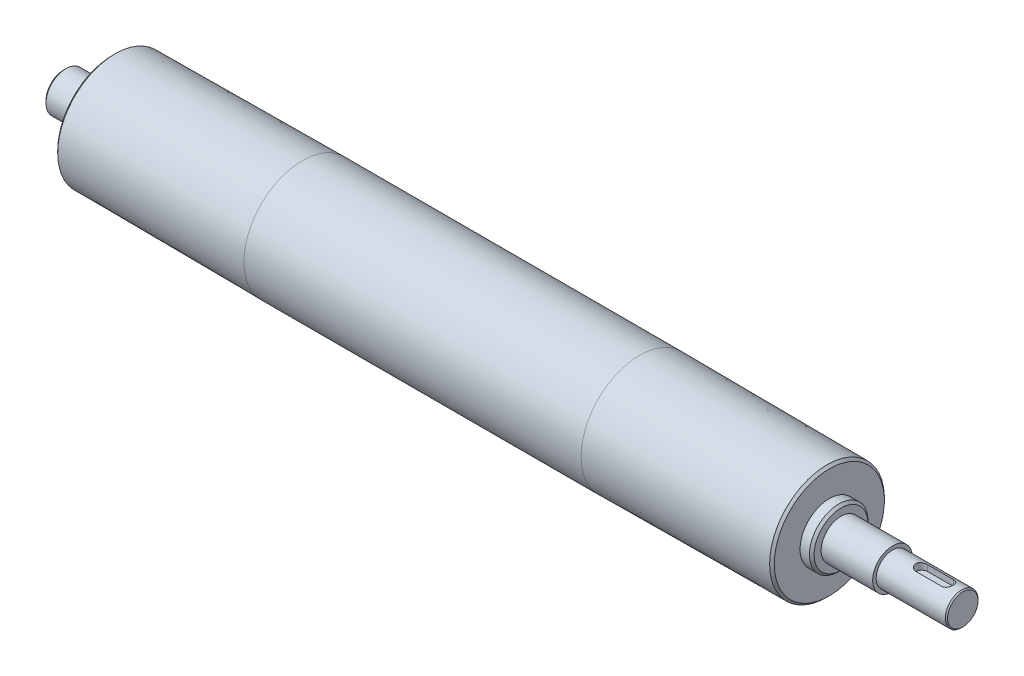
ISO-10303-21;
HEADER;
FILE_DESCRIPTION(('STEP AP214'),'2;1');
FILE_NAME('part.step','',(''),(''),'','','');
FILE_SCHEMA(('AUTOMOTIVE_DESIGN { 1 0 10303 214 1 1 1 1 }'));
ENDSEC;
DATA;
#1=APPLICATION_CONTEXT('core data for automotive mechanical design processes');
#2=APPLICATION_PROTOCOL_DEFINITION('international standard','automotive_design',2000,#1);
#3=PRODUCT_CONTEXT('',#1,'mechanical');
#4=PRODUCT('Part','Part','',(#3));
#5=PRODUCT_RELATED_PRODUCT_CATEGORY('part','',(#4));
#6=PRODUCT_DEFINITION_FORMATION('','',#4);
#7=PRODUCT_DEFINITION_CONTEXT('part definition',#1,'design');
#8=PRODUCT_DEFINITION('design','',#6,#7);
#9=PRODUCT_DEFINITION_SHAPE('','',#8);
#10=(LENGTH_UNIT() NAMED_UNIT(*) SI_UNIT(.MILLI.,.METRE.));
#11=(NAMED_UNIT(*) PLANE_ANGLE_UNIT() SI_UNIT($,.RADIAN.));
#12=(NAMED_UNIT(*) SI_UNIT($,.STERADIAN.) SOLID_ANGLE_UNIT());
#13=UNCERTAINTY_MEASURE_WITH_UNIT(LENGTH_MEASURE(1.E-05),#10,'distance_accuracy_value','');
#14=(GEOMETRIC_REPRESENTATION_CONTEXT(3) GLOBAL_UNCERTAINTY_ASSIGNED_CONTEXT((#13)) GLOBAL_UNIT_ASSIGNED_CONTEXT((#10,
#11,#12)) REPRESENTATION_CONTEXT('',''));
#15=CARTESIAN_POINT('',(0.,0.,0.));
#16=DIRECTION('',(0.,0.,1.));
#17=DIRECTION('',(1.,0.,0.));
#18=AXIS2_PLACEMENT_3D('',#15,#16,#17);
#19=CARTESIAN_POINT('',(-174.,0.,0.));
#20=DIRECTION('',(-1.,0.,0.));
#21=DIRECTION('',(0.,0.,1.));
#22=AXIS2_PLACEMENT_3D('',#19,#20,#21);
#23=CYLINDRICAL_SURFACE('',#22,7.);
#24=CARTESIAN_POINT('',(209.5,0.,0.));
#25=DIRECTION('',(-1.,0.,0.));
#26=DIRECTION('',(0.,0.,1.));
#27=AXIS2_PLACEMENT_3D('',#24,#25,#26);
#28=CIRCLE('',#27,7.);
#29=CARTESIAN_POINT('',(209.5,0.,7.));
#30=VERTEX_POINT('',#29);
#31=EDGE_CURVE('E133',#30,#30,#28,.T.);
#32=ORIENTED_EDGE('',*,*,#31,.T.);
#33=EDGE_LOOP('',(#32));
#34=FACE_BOUND('',#33,.T.);
#35=CARTESIAN_POINT('',(180.,0.,0.));
#36=DIRECTION('',(-1.,0.,0.));
#37=DIRECTION('',(0.,0.,1.));
#38=AXIS2_PLACEMENT_3D('',#35,#36,#37);
#39=CIRCLE('',#38,7.);
#40=CARTESIAN_POINT('',(180.,0.,7.));
#41=VERTEX_POINT('',#40);
#42=EDGE_CURVE('E130',#41,#41,#39,.T.);
#43=ORIENTED_EDGE('',*,*,#42,.F.);
#44=EDGE_LOOP('',(#43));
#45=FACE_BOUND('',#44,.T.);
#46=CARTESIAN_POINT('',(203.5,6.53834841531101,2.5));
#47=CARTESIAN_POINT('',(203.567889245729,6.53833653785133,2.50000932220903));
#48=CARTESIAN_POINT('',(203.635771932639,6.53940549922738,2.49723485076694));
#49=CARTESIAN_POINT('',(203.771003910611,6.54361657478134,2.4861910211816));
#50=CARTESIAN_POINT('',(203.838353358606,6.54675805418062,2.47792334551208));
#51=CARTESIAN_POINT('',(203.971821414603,6.55501217637942,2.456001752859));
#52=CARTESIAN_POINT('',(204.03794333634,6.56011831705676,2.44236559963956));
#53=CARTESIAN_POINT('',(204.168701835108,6.57213177854175,2.40985115466649));
#54=CARTESIAN_POINT('',(204.233338346312,6.57903917900746,2.39097263107436));
#55=CARTESIAN_POINT('',(204.424264366477,6.6021493436571,2.32673964179204));
#56=CARTESIAN_POINT('',(204.547790452136,6.62075475340845,2.27375112606985));
#57=CARTESIAN_POINT('',(204.784230333128,6.6622539736071,2.14910757865424));
#58=CARTESIAN_POINT('',(204.897136316735,6.68515090424876,2.07743895048847));
#59=CARTESIAN_POINT('',(205.114215213353,6.73379913792224,1.91402571101967));
#60=CARTESIAN_POINT('',(205.217846475196,6.75962864041372,1.82158337146742));
#61=CARTESIAN_POINT('',(205.408508704716,6.81057592323031,1.62073388776328));
#62=CARTESIAN_POINT('',(205.495536579243,6.83569357019868,1.51232377552671));
#63=CARTESIAN_POINT('',(205.653089855455,6.88331133279047,1.27853915335932));
#64=CARTESIAN_POINT('',(205.72303152186,6.90570835223797,1.15274833789182));
#65=CARTESIAN_POINT('',(205.840536646797,6.94442357672634,0.890250825476609));
#66=CARTESIAN_POINT('',(205.888107779046,6.96074386585466,0.753547890540304));
#67=CARTESIAN_POINT('',(205.957640602182,6.98491050510711,0.478829979256156));
#68=CARTESIAN_POINT('',(205.980539130471,6.99306594352515,0.341079835227449));
#69=CARTESIAN_POINT('',(206.003068402778,7.00108798053822,0.0634643052968886));
#70=CARTESIAN_POINT('',(206.002705586035,7.00095687302702,-0.0764004845074625));
#71=CARTESIAN_POINT('',(205.979288726239,6.99262258049077,-0.34759325848696));
#72=CARTESIAN_POINT('',(205.957255205801,6.98478243583516,-0.479022407078735));
#73=CARTESIAN_POINT('',(205.892826575841,6.96237832507347,-0.73617581214362));
#74=CARTESIAN_POINT('',(205.850430315637,6.94781397899037,-0.861899745780475));
#75=CARTESIAN_POINT('',(205.745953088435,6.91316506890368,-1.10616102429809));
#76=CARTESIAN_POINT('',(205.68360428504,6.89300592164314,-1.22457279066908));
#77=CARTESIAN_POINT('',(205.541220664777,6.8492335561632,-1.44953531305525));
#78=CARTESIAN_POINT('',(205.461180476216,6.82561928959263,-1.55608245176772));
#79=CARTESIAN_POINT('',(205.280676736343,6.77590547805489,-1.76032445256071));
#80=CARTESIAN_POINT('',(205.179350276855,6.74974055843875,-1.85724185700418));
#81=CARTESIAN_POINT('',(204.961672635834,6.69890342468975,-2.03299914621297));
#82=CARTESIAN_POINT('',(204.845316094832,6.67423174765257,-2.11183255456463));
#83=CARTESIAN_POINT('',(204.598057401478,6.62877803875405,-2.25049860898459));
#84=CARTESIAN_POINT('',(204.466921024495,6.60807875118994,-2.30994207989625));
#85=CARTESIAN_POINT('',(204.195635198418,6.57388213610267,-2.40555439725849));
#86=CARTESIAN_POINT('',(204.055500858831,6.56037307165054,-2.44176119399954));
#87=CARTESIAN_POINT('',(203.844969455736,6.54708542245562,-2.47705497148627));
#88=CARTESIAN_POINT('',(203.776263698228,6.54382010967907,-2.48565347586445));
#89=CARTESIAN_POINT('',(203.638384835808,6.53944910829676,-2.49712352174882));
#90=CARTESIAN_POINT('',(203.569212332899,6.53834103140935,-2.50000139665368));
#91=CARTESIAN_POINT('',(203.5,6.53834841531101,-2.5));
#92=B_SPLINE_CURVE_WITH_KNOTS('',3,(#46,#47,#48,#49,#50,#51,#52,#53,#54,#55,#56,#57,#58,#59,#60,
#61,#62,#63,#64,#65,#66,#67,#68,#69,#70,#71,#72,#73,#74,#75,#76,#77,#78,#79,#80,#81,#82,#83,#84,
#85,#86,#87,#88,#89,#90,#91),.UNSPECIFIED.,.F.,.F.,(4,2,2,2,2,2,2,2,2,2,2,2,2,2,2,2,2,2,2,2,2,2,
4),(0.,0.203591628551585,0.407120929225507,0.609982356545697,0.812852756636004,1.21793118555515,
1.62330528148473,2.04515972311932,2.46709267811843,2.90188398965563,3.33652604665239,
3.75400993940863,4.17137826416923,4.56998920861348,4.96862268086889,5.37284909448641,
5.77719841367923,6.20315837945089,6.62927065674719,7.06347329058504,7.49696496492445,
7.70468580162772,7.91217653896406),.UNSPECIFIED.);
#93=CARTESIAN_POINT('',(203.5,6.53834841531102,2.5));
#94=VERTEX_POINT('',#93);
#95=CARTESIAN_POINT('',(203.5,6.53834841531102,-2.5));
#96=VERTEX_POINT('',#95);
#97=EDGE_CURVE('E11',#94,#96,#92,.T.);
#98=ORIENTED_EDGE('',*,*,#97,.F.);
#99=DIRECTION('',(-1.,0.,0.));
#100=VECTOR('',#99,1.);
#101=CARTESIAN_POINT('',(-174.,6.53834841531101,2.5));
#102=LINE('',#101,#100);
#103=CARTESIAN_POINT('',(192.5,6.53834841531101,2.5));
#104=VERTEX_POINT('',#103);
#105=EDGE_CURVE('E163',#94,#104,#102,.T.);
#106=ORIENTED_EDGE('',*,*,#105,.T.);
#107=CARTESIAN_POINT('',(192.5,6.53834841531101,-2.5));
#108=CARTESIAN_POINT('',(192.432110754271,6.53833653785133,-2.50000932220903));
#109=CARTESIAN_POINT('',(192.364228067361,6.53940549922738,-2.49723485076694));
#110=CARTESIAN_POINT('',(192.228996089389,6.54361657478134,-2.4861910211816));
#111=CARTESIAN_POINT('',(192.161646641394,6.54675805418062,-2.47792334551208));
#112=CARTESIAN_POINT('',(192.028178585397,6.55501217637942,-2.456001752859));
#113=CARTESIAN_POINT('',(191.96205666366,6.56011831705676,-2.44236559963955));
#114=CARTESIAN_POINT('',(191.831298164892,6.57213177854175,-2.40985115466648));
#115=CARTESIAN_POINT('',(191.766661653688,6.57903917900746,-2.39097263107435));
#116=CARTESIAN_POINT('',(191.575735633522,6.6021493436571,-2.32673964179204));
#117=CARTESIAN_POINT('',(191.452209547864,6.62075475340845,-2.27375112606985));
#118=CARTESIAN_POINT('',(191.215769666872,6.6622539736071,-2.14910757865424));
#119=CARTESIAN_POINT('',(191.102863683264,6.68515090424876,-2.07743895048847));
#120=CARTESIAN_POINT('',(190.885784786647,6.73379913792224,-1.91402571101968));
#121=CARTESIAN_POINT('',(190.782153524804,6.75962864041372,-1.82158337146742));
#122=CARTESIAN_POINT('',(190.591491295284,6.81057592323031,-1.62073388776328));
#123=CARTESIAN_POINT('',(190.504463420757,6.83569357019868,-1.51232377552671));
#124=CARTESIAN_POINT('',(190.346910144545,6.88331133279047,-1.27853915335932));
#125=CARTESIAN_POINT('',(190.276968478139,6.90570835223797,-1.15274833789182));
#126=CARTESIAN_POINT('',(190.159463353203,6.94442357672634,-0.890250825476609));
#127=CARTESIAN_POINT('',(190.111892220954,6.96074386585466,-0.753547890540304));
#128=CARTESIAN_POINT('',(190.042359397818,6.98491050510711,-0.478829979256155));
#129=CARTESIAN_POINT('',(190.019460869529,6.99306594352515,-0.341079835227448));
#130=CARTESIAN_POINT('',(189.996931597222,7.00108798053822,-0.0634643052968871));
#131=CARTESIAN_POINT('',(189.997294413965,7.00095687302702,0.0764004845074633));
#132=CARTESIAN_POINT('',(190.020711273761,6.99262258049077,0.347593258486962));
#133=CARTESIAN_POINT('',(190.042744794199,6.98478243583516,0.479022407078739));
#134=CARTESIAN_POINT('',(190.107173424159,6.96237832507347,0.736175812143625));
#135=CARTESIAN_POINT('',(190.149569684362,6.94781397899037,0.861899745780477));
#136=CARTESIAN_POINT('',(190.254046911565,6.91316506890368,1.10616102429809));
#137=CARTESIAN_POINT('',(190.31639571496,6.89300592164314,1.22457279066908));
#138=CARTESIAN_POINT('',(190.458779335223,6.8492335561632,1.44953531305525));
#139=CARTESIAN_POINT('',(190.538819523784,6.82561928959263,1.55608245176772));
#140=CARTESIAN_POINT('',(190.719323263657,6.7759054780549,1.7603244525607));
#141=CARTESIAN_POINT('',(190.820649723145,6.74974055843875,1.85724185700416));
#142=CARTESIAN_POINT('',(191.038327364166,6.69890342468976,2.03299914621295));
#143=CARTESIAN_POINT('',(191.154683905168,6.67423174765257,2.11183255456462));
#144=CARTESIAN_POINT('',(191.401942598522,6.62877803875405,2.25049860898459));
#145=CARTESIAN_POINT('',(191.533078975505,6.60807875118994,2.30994207989625));
#146=CARTESIAN_POINT('',(191.804364801582,6.57388213610267,2.40555439725849));
#147=CARTESIAN_POINT('',(191.944499141169,6.56037307165054,2.44176119399954));
#148=CARTESIAN_POINT('',(192.155030544264,6.54708542245562,2.47705497148627));
#149=CARTESIAN_POINT('',(192.223736301772,6.54382010967907,2.48565347586445));
#150=CARTESIAN_POINT('',(192.361615164192,6.53944910829676,2.49712352174882));
#151=CARTESIAN_POINT('',(192.430787667101,6.53834103140935,2.50000139665368));
#152=CARTESIAN_POINT('',(192.5,6.53834841531101,2.5));
#153=B_SPLINE_CURVE_WITH_KNOTS('',3,(#107,#108,#109,#110,#111,#112,#113,#114,#115,#116,#117,
#118,#119,#120,#121,#122,#123,#124,#125,#126,#127,#128,#129,#130,#131,#132,#133,#134,#135,#136,
#137,#138,#139,#140,#141,#142,#143,#144,#145,#146,#147,#148,#149,#150,#151,#152),.UNSPECIFIED.,
.F.,.F.,(4,2,2,2,2,2,2,2,2,2,2,2,2,2,2,2,2,2,2,2,2,2,4),(0.,0.203591628551613,0.407120929225535,
0.609982356545727,0.812852756636003,1.21793118555515,1.62330528148473,2.04515972311932,
2.46709267811843,2.90188398965563,3.33652604665239,3.75400993940863,4.17137826416923,
4.56998920861349,4.96862268086889,5.37284909448641,5.77719841367923,6.20315837945085,
6.62927065674719,7.06347329058504,7.49696496492445,7.70468580162772,7.91217653896406),.UNSPECIFIED.);
#154=CARTESIAN_POINT('',(192.5,6.53834841531101,-2.5));
#155=VERTEX_POINT('',#154);
#156=EDGE_CURVE('E166',#155,#104,#153,.T.);
#157=ORIENTED_EDGE('',*,*,#156,.F.);
#158=DIRECTION('',(-1.,0.,0.));
#159=VECTOR('',#158,1.);
#160=CARTESIAN_POINT('',(-174.,6.53834841531101,-2.5));
#161=LINE('',#160,#159);
#162=EDGE_CURVE('E44',#96,#155,#161,.T.);
#163=ORIENTED_EDGE('',*,*,#162,.F.);
#164=EDGE_LOOP('',(#98,#106,#157,#163));
#165=FACE_BOUND('',#164,.T.);
#166=ADVANCED_FACE('F31',(#34,#45,#165),#23,.T.);
#167=CARTESIAN_POINT('',(-72.,0.,0.));
#168=DIRECTION('',(1.,0.,0.));
#169=DIRECTION('',(0.,0.,-1.));
#170=AXIS2_PLACEMENT_3D('',#167,#168,#169);
#171=CONICAL_SURFACE('',#170,25.,0.00624991862169927);
#172=CARTESIAN_POINT('',(-152.,0.,0.));
#173=DIRECTION('',(-1.,0.,0.));
#174=DIRECTION('',(0.,0.,1.));
#175=AXIS2_PLACEMENT_3D('',#172,#173,#174);
#176=CIRCLE('',#175,24.5);
#177=CARTESIAN_POINT('',(-152.,0.,24.5));
#178=VERTEX_POINT('',#177);
#179=EDGE_CURVE('E160',#178,#178,#176,.T.);
#180=ORIENTED_EDGE('',*,*,#179,.F.);
#181=EDGE_LOOP('',(#180));
#182=FACE_BOUND('',#181,.T.);
#183=CARTESIAN_POINT('',(-72.,0.,0.));
#184=DIRECTION('',(-1.,0.,0.));
#185=DIRECTION('',(0.,0.,1.));
#186=AXIS2_PLACEMENT_3D('',#183,#184,#185);
#187=CIRCLE('',#186,25.);
#188=CARTESIAN_POINT('',(-72.,0.,25.));
#189=VERTEX_POINT('',#188);
#190=EDGE_CURVE('E82',#189,#189,#187,.T.);
#191=ORIENTED_EDGE('',*,*,#190,.T.);
#192=EDGE_LOOP('',(#191));
#193=FACE_BOUND('',#192,.T.);
#194=ADVANCED_FACE('F33',(#182,#193),#171,.T.);
#195=CARTESIAN_POINT('',(-152.,0.,0.));
#196=DIRECTION('',(1.,0.,0.));
#197=DIRECTION('',(0.,0.,-1.));
#198=AXIS2_PLACEMENT_3D('',#195,#196,#197);
#199=CONICAL_SURFACE('',#198,24.5,0.785398163397459);
#200=CARTESIAN_POINT('',(-153.,0.,0.));
#201=DIRECTION('',(-1.,0.,0.));
#202=DIRECTION('',(0.,0.,1.));
#203=AXIS2_PLACEMENT_3D('',#200,#201,#202);
#204=CIRCLE('',#203,23.5);
#205=CARTESIAN_POINT('',(-153.,0.,23.5));
#206=VERTEX_POINT('',#205);
#207=EDGE_CURVE('E157',#206,#206,#204,.T.);
#208=ORIENTED_EDGE('',*,*,#207,.F.);
#209=EDGE_LOOP('',(#208));
#210=FACE_BOUND('',#209,.T.);
#211=ORIENTED_EDGE('',*,*,#179,.T.);
#212=EDGE_LOOP('',(#211));
#213=FACE_BOUND('',#212,.T.);
#214=ADVANCED_FACE('F233',(#210,#213),#199,.T.);
#215=CARTESIAN_POINT('',(-153.,0.,-23.5));
#216=DIRECTION('',(1.,0.,0.));
#217=DIRECTION('',(0.,0.,-1.));
#218=AXIS2_PLACEMENT_3D('',#215,#216,#217);
#219=PLANE('',#218);
#220=CARTESIAN_POINT('',(-153.,0.,0.));
#221=DIRECTION('',(-1.,0.,0.));
#222=DIRECTION('',(0.,0.,1.));
#223=AXIS2_PLACEMENT_3D('',#220,#221,#222);
#224=CIRCLE('',#223,12.5);
#225=CARTESIAN_POINT('',(-153.,0.,12.5));
#226=VERTEX_POINT('',#225);
#227=EDGE_CURVE('E154',#226,#226,#224,.T.);
#228=ORIENTED_EDGE('',*,*,#227,.F.);
#229=EDGE_LOOP('',(#228));
#230=FACE_BOUND('',#229,.T.);
#231=ORIENTED_EDGE('',*,*,#207,.T.);
#232=EDGE_LOOP('',(#231));
#233=FACE_BOUND('',#232,.T.);
#234=ADVANCED_FACE('F399',(#230,#233),#219,.F.);
#235=CARTESIAN_POINT('',(-174.,0.,0.));
#236=DIRECTION('',(-1.,0.,0.));
#237=DIRECTION('',(0.,0.,1.));
#238=AXIS2_PLACEMENT_3D('',#235,#236,#237);
#239=CYLINDRICAL_SURFACE('',#238,12.5);
#240=CARTESIAN_POINT('',(-157.,0.,0.));
#241=DIRECTION('',(-1.,0.,0.));
#242=DIRECTION('',(0.,0.,1.));
#243=AXIS2_PLACEMENT_3D('',#240,#241,#242);
#244=CIRCLE('',#243,12.5);
#245=CARTESIAN_POINT('',(-157.,0.,12.5));
#246=VERTEX_POINT('',#245);
#247=EDGE_CURVE('E151',#246,#246,#244,.T.);
#248=ORIENTED_EDGE('',*,*,#247,.F.);
#249=EDGE_LOOP('',(#248));
#250=FACE_BOUND('',#249,.T.);
#251=ORIENTED_EDGE('',*,*,#227,.T.);
#252=EDGE_LOOP('',(#251));
#253=FACE_BOUND('',#252,.T.);
#254=ADVANCED_FACE('F389',(#250,#253),#239,.T.);
#255=CARTESIAN_POINT('',(-157.,0.,0.));
#256=DIRECTION('',(1.,0.,0.));
#257=DIRECTION('',(0.,0.,-1.));
#258=AXIS2_PLACEMENT_3D('',#255,#256,#257);
#259=CONICAL_SURFACE('',#258,12.5,0.78539816339745);
#260=CARTESIAN_POINT('',(-158.,0.,0.));
#261=DIRECTION('',(-1.,0.,0.));
#262=DIRECTION('',(0.,0.,1.));
#263=AXIS2_PLACEMENT_3D('',#260,#261,#262);
#264=CIRCLE('',#263,11.5);
#265=CARTESIAN_POINT('',(-158.,0.,11.5));
#266=VERTEX_POINT('',#265);
#267=EDGE_CURVE('E148',#266,#266,#264,.T.);
#268=ORIENTED_EDGE('',*,*,#267,.F.);
#269=EDGE_LOOP('',(#268));
#270=FACE_BOUND('',#269,.T.);
#271=ORIENTED_EDGE('',*,*,#247,.T.);
#272=EDGE_LOOP('',(#271));
#273=FACE_BOUND('',#272,.T.);
#274=ADVANCED_FACE('F379',(#270,#273),#259,.T.);
#275=CARTESIAN_POINT('',(-158.,0.,-11.5));
#276=DIRECTION('',(1.,0.,0.));
#277=DIRECTION('',(0.,0.,-1.));
#278=AXIS2_PLACEMENT_3D('',#275,#276,#277);
#279=PLANE('',#278);
#280=CARTESIAN_POINT('',(-158.,0.,0.));
#281=DIRECTION('',(-1.,0.,0.));
#282=DIRECTION('',(0.,0.,1.));
#283=AXIS2_PLACEMENT_3D('',#280,#281,#282);
#284=CIRCLE('',#283,8.5);
#285=CARTESIAN_POINT('',(-158.,0.,8.5));
#286=VERTEX_POINT('',#285);
#287=EDGE_CURVE('E145',#286,#286,#284,.T.);
#288=ORIENTED_EDGE('',*,*,#287,.F.);
#289=EDGE_LOOP('',(#288));
#290=FACE_BOUND('',#289,.T.);
#291=ORIENTED_EDGE('',*,*,#267,.T.);
#292=EDGE_LOOP('',(#291));
#293=FACE_BOUND('',#292,.T.);
#294=ADVANCED_FACE('F369',(#290,#293),#279,.F.);
#295=CARTESIAN_POINT('',(-174.,0.,0.));
#296=DIRECTION('',(-1.,0.,0.));
#297=DIRECTION('',(0.,0.,1.));
#298=AXIS2_PLACEMENT_3D('',#295,#296,#297);
#299=CYLINDRICAL_SURFACE('',#298,8.5);
#300=CARTESIAN_POINT('',(-173.,0.,0.));
#301=DIRECTION('',(-1.,0.,0.));
#302=DIRECTION('',(0.,0.,1.));
#303=AXIS2_PLACEMENT_3D('',#300,#301,#302);
#304=CIRCLE('',#303,8.49999999999999);
#305=CARTESIAN_POINT('',(-173.,0.,8.49999999999999));
#306=VERTEX_POINT('',#305);
#307=EDGE_CURVE('E142',#306,#306,#304,.T.);
#308=ORIENTED_EDGE('',*,*,#307,.F.);
#309=EDGE_LOOP('',(#308));
#310=FACE_BOUND('',#309,.T.);
#311=ORIENTED_EDGE('',*,*,#287,.T.);
#312=EDGE_LOOP('',(#311));
#313=FACE_BOUND('',#312,.T.);
#314=ADVANCED_FACE('F359',(#310,#313),#299,.T.);
#315=CARTESIAN_POINT('',(-173.,0.,0.));
#316=DIRECTION('',(1.,0.,0.));
#317=DIRECTION('',(0.,0.,-1.));
#318=AXIS2_PLACEMENT_3D('',#315,#316,#317);
#319=CONICAL_SURFACE('',#318,8.49999999999999,0.785398163397458);
#320=CARTESIAN_POINT('',(-174.,0.,0.));
#321=DIRECTION('',(-1.,0.,0.));
#322=DIRECTION('',(0.,0.,1.));
#323=AXIS2_PLACEMENT_3D('',#320,#321,#322);
#324=CIRCLE('',#323,7.49999999999998);
#325=CARTESIAN_POINT('',(-174.,0.,7.49999999999998));
#326=VERTEX_POINT('',#325);
#327=EDGE_CURVE('E139',#326,#326,#324,.T.);
#328=ORIENTED_EDGE('',*,*,#327,.F.);
#329=EDGE_LOOP('',(#328));
#330=FACE_BOUND('',#329,.T.);
#331=ORIENTED_EDGE('',*,*,#307,.T.);
#332=EDGE_LOOP('',(#331));
#333=FACE_BOUND('',#332,.T.);
#334=ADVANCED_FACE('F349',(#330,#333),#319,.T.);
#335=CARTESIAN_POINT('',(-174.,0.,-7.49999999999998));
#336=DIRECTION('',(1.,0.,0.));
#337=DIRECTION('',(0.,0.,-1.));
#338=AXIS2_PLACEMENT_3D('',#335,#336,#337);
#339=PLANE('',#338);
#340=ORIENTED_EDGE('',*,*,#327,.T.);
#341=EDGE_LOOP('',(#340));
#342=FACE_BOUND('',#341,.T.);
#343=ADVANCED_FACE('F339',(#342),#339,.F.);
#344=CARTESIAN_POINT('',(210.,0.,-6.50000000000001));
#345=DIRECTION('',(-1.,0.,0.));
#346=DIRECTION('',(0.,0.,1.));
#347=AXIS2_PLACEMENT_3D('',#344,#345,#346);
#348=PLANE('',#347);
#349=CARTESIAN_POINT('',(210.,0.,0.));
#350=DIRECTION('',(-1.,0.,0.));
#351=DIRECTION('',(0.,0.,1.));
#352=AXIS2_PLACEMENT_3D('',#349,#350,#351);
#353=CIRCLE('',#352,6.50000000000001);
#354=CARTESIAN_POINT('',(210.,0.,6.50000000000001));
#355=VERTEX_POINT('',#354);
#356=EDGE_CURVE('E136',#355,#355,#353,.T.);
#357=ORIENTED_EDGE('',*,*,#356,.F.);
#358=EDGE_LOOP('',(#357));
#359=FACE_BOUND('',#358,.T.);
#360=ADVANCED_FACE('F224',(#359),#348,.F.);
#361=CARTESIAN_POINT('',(210.,0.,0.));
#362=DIRECTION('',(-1.,0.,0.));
#363=DIRECTION('',(0.,0.,1.));
#364=AXIS2_PLACEMENT_3D('',#361,#362,#363);
#365=CONICAL_SURFACE('',#364,6.50000000000001,0.78539816339738);
#366=ORIENTED_EDGE('',*,*,#31,.F.);
#367=EDGE_LOOP('',(#366));
#368=FACE_BOUND('',#367,.T.);
#369=ORIENTED_EDGE('',*,*,#356,.T.);
#370=EDGE_LOOP('',(#369));
#371=FACE_BOUND('',#370,.T.);
#372=ADVANCED_FACE('F219',(#368,#371),#365,.T.);
#373=CARTESIAN_POINT('',(180.,0.,-8.5));
#374=DIRECTION('',(-1.,0.,0.));
#375=DIRECTION('',(0.,0.,1.));
#376=AXIS2_PLACEMENT_3D('',#373,#374,#375);
#377=PLANE('',#376);
#378=CARTESIAN_POINT('',(180.,0.,0.));
#379=DIRECTION('',(-1.,0.,0.));
#380=DIRECTION('',(0.,0.,1.));
#381=AXIS2_PLACEMENT_3D('',#378,#379,#380);
#382=CIRCLE('',#381,8.5);
#383=CARTESIAN_POINT('',(180.,0.,8.5));
#384=VERTEX_POINT('',#383);
#385=EDGE_CURVE('E127',#384,#384,#382,.T.);
#386=ORIENTED_EDGE('',*,*,#385,.F.);
#387=EDGE_LOOP('',(#386));
#388=FACE_BOUND('',#387,.T.);
#389=ORIENTED_EDGE('',*,*,#42,.T.);
#390=EDGE_LOOP('',(#389));
#391=FACE_BOUND('',#390,.T.);
#392=ADVANCED_FACE('F216',(#388,#391),#377,.F.);
#393=CARTESIAN_POINT('',(-174.,0.,0.));
#394=DIRECTION('',(-1.,0.,0.));
#395=DIRECTION('',(0.,0.,1.));
#396=AXIS2_PLACEMENT_3D('',#393,#394,#395);
#397=CYLINDRICAL_SURFACE('',#396,8.5);
#398=CARTESIAN_POINT('',(158.,0.,0.));
#399=DIRECTION('',(-1.,0.,0.));
#400=DIRECTION('',(0.,0.,1.));
#401=AXIS2_PLACEMENT_3D('',#398,#399,#400);
#402=CIRCLE('',#401,8.5);
#403=CARTESIAN_POINT('',(158.,0.,8.5));
#404=VERTEX_POINT('',#403);
#405=EDGE_CURVE('E124',#404,#404,#402,.T.);
#406=ORIENTED_EDGE('',*,*,#405,.F.);
#407=EDGE_LOOP('',(#406));
#408=FACE_BOUND('',#407,.T.);
#409=ORIENTED_EDGE('',*,*,#385,.T.);
#410=EDGE_LOOP('',(#409));
#411=FACE_BOUND('',#410,.T.);
#412=ADVANCED_FACE('F213',(#408,#411),#397,.T.);
#413=CARTESIAN_POINT('',(158.,0.,-11.5));
#414=DIRECTION('',(-1.,0.,0.));
#415=DIRECTION('',(0.,0.,1.));
#416=AXIS2_PLACEMENT_3D('',#413,#414,#415);
#417=PLANE('',#416);
#418=CARTESIAN_POINT('',(158.,0.,0.));
#419=DIRECTION('',(-1.,0.,0.));
#420=DIRECTION('',(0.,0.,1.));
#421=AXIS2_PLACEMENT_3D('',#418,#419,#420);
#422=CIRCLE('',#421,11.5);
#423=CARTESIAN_POINT('',(158.,0.,11.5));
#424=VERTEX_POINT('',#423);
#425=EDGE_CURVE('E121',#424,#424,#422,.T.);
#426=ORIENTED_EDGE('',*,*,#425,.F.);
#427=EDGE_LOOP('',(#426));
#428=FACE_BOUND('',#427,.T.);
#429=ORIENTED_EDGE('',*,*,#405,.T.);
#430=EDGE_LOOP('',(#429));
#431=FACE_BOUND('',#430,.T.);
#432=ADVANCED_FACE('F209',(#428,#431),#417,.F.);
#433=CARTESIAN_POINT('',(158.,0.,0.));
#434=DIRECTION('',(-1.,0.,0.));
#435=DIRECTION('',(0.,0.,1.));
#436=AXIS2_PLACEMENT_3D('',#433,#434,#435);
#437=CONICAL_SURFACE('',#436,11.5,0.78539816339745);
#438=CARTESIAN_POINT('',(157.,0.,0.));
#439=DIRECTION('',(-1.,0.,0.));
#440=DIRECTION('',(0.,0.,1.));
#441=AXIS2_PLACEMENT_3D('',#438,#439,#440);
#442=CIRCLE('',#441,12.5);
#443=CARTESIAN_POINT('',(157.,0.,12.5));
#444=VERTEX_POINT('',#443);
#445=EDGE_CURVE('E118',#444,#444,#442,.T.);
#446=ORIENTED_EDGE('',*,*,#445,.F.);
#447=EDGE_LOOP('',(#446));
#448=FACE_BOUND('',#447,.T.);
#449=ORIENTED_EDGE('',*,*,#425,.T.);
#450=EDGE_LOOP('',(#449));
#451=FACE_BOUND('',#450,.T.);
#452=ADVANCED_FACE('F205',(#448,#451),#437,.T.);
#453=CARTESIAN_POINT('',(-174.,0.,0.));
#454=DIRECTION('',(-1.,0.,0.));
#455=DIRECTION('',(0.,0.,1.));
#456=AXIS2_PLACEMENT_3D('',#453,#454,#455);
#457=CYLINDRICAL_SURFACE('',#456,12.5);
#458=CARTESIAN_POINT('',(153.,0.,0.));
#459=DIRECTION('',(-1.,0.,0.));
#460=DIRECTION('',(0.,0.,1.));
#461=AXIS2_PLACEMENT_3D('',#458,#459,#460);
#462=CIRCLE('',#461,12.5);
#463=CARTESIAN_POINT('',(153.,0.,12.5));
#464=VERTEX_POINT('',#463);
#465=EDGE_CURVE('E115',#464,#464,#462,.T.);
#466=ORIENTED_EDGE('',*,*,#465,.F.);
#467=EDGE_LOOP('',(#466));
#468=FACE_BOUND('',#467,.T.);
#469=ORIENTED_EDGE('',*,*,#445,.T.);
#470=EDGE_LOOP('',(#469));
#471=FACE_BOUND('',#470,.T.);
#472=ADVANCED_FACE('F201',(#468,#471),#457,.T.);
#473=CARTESIAN_POINT('',(153.,0.,-23.5));
#474=DIRECTION('',(-1.,0.,0.));
#475=DIRECTION('',(0.,0.,1.));
#476=AXIS2_PLACEMENT_3D('',#473,#474,#475);
#477=PLANE('',#476);
#478=CARTESIAN_POINT('',(153.,0.,0.));
#479=DIRECTION('',(-1.,0.,0.));
#480=DIRECTION('',(0.,0.,1.));
#481=AXIS2_PLACEMENT_3D('',#478,#479,#480);
#482=CIRCLE('',#481,23.5);
#483=CARTESIAN_POINT('',(153.,0.,23.5));
#484=VERTEX_POINT('',#483);
#485=EDGE_CURVE('E112',#484,#484,#482,.T.);
#486=ORIENTED_EDGE('',*,*,#485,.F.);
#487=EDGE_LOOP('',(#486));
#488=FACE_BOUND('',#487,.T.);
#489=ORIENTED_EDGE('',*,*,#465,.T.);
#490=EDGE_LOOP('',(#489));
#491=FACE_BOUND('',#490,.T.);
#492=ADVANCED_FACE('F197',(#488,#491),#477,.F.);
#493=CARTESIAN_POINT('',(153.,0.,0.));
#494=DIRECTION('',(-1.,0.,0.));
#495=DIRECTION('',(0.,0.,1.));
#496=AXIS2_PLACEMENT_3D('',#493,#494,#495);
#497=CONICAL_SURFACE('',#496,23.5,0.78539816339745);
#498=CARTESIAN_POINT('',(152.,0.,0.));
#499=DIRECTION('',(-1.,0.,0.));
#500=DIRECTION('',(0.,0.,1.));
#501=AXIS2_PLACEMENT_3D('',#498,#499,#500);
#502=CIRCLE('',#501,24.5);
#503=CARTESIAN_POINT('',(152.,0.,24.5));
#504=VERTEX_POINT('',#503);
#505=EDGE_CURVE('E109',#504,#504,#502,.T.);
#506=ORIENTED_EDGE('',*,*,#505,.F.);
#507=EDGE_LOOP('',(#506));
#508=FACE_BOUND('',#507,.T.);
#509=ORIENTED_EDGE('',*,*,#485,.T.);
#510=EDGE_LOOP('',(#509));
#511=FACE_BOUND('',#510,.T.);
#512=ADVANCED_FACE('F193',(#508,#511),#497,.T.);
#513=CARTESIAN_POINT('',(152.,0.,0.));
#514=DIRECTION('',(-1.,0.,0.));
#515=DIRECTION('',(0.,0.,1.));
#516=AXIS2_PLACEMENT_3D('',#513,#514,#515);
#517=CONICAL_SURFACE('',#516,24.5,0.00624991862169858);
#518=CARTESIAN_POINT('',(72.,0.,0.));
#519=DIRECTION('',(-1.,0.,0.));
#520=DIRECTION('',(0.,0.,1.));
#521=AXIS2_PLACEMENT_3D('',#518,#519,#520);
#522=CIRCLE('',#521,25.);
#523=CARTESIAN_POINT('',(72.,0.,25.));
#524=VERTEX_POINT('',#523);
#525=EDGE_CURVE('E106',#524,#524,#522,.T.);
#526=ORIENTED_EDGE('',*,*,#525,.F.);
#527=EDGE_LOOP('',(#526));
#528=FACE_BOUND('',#527,.T.);
#529=ORIENTED_EDGE('',*,*,#505,.T.);
#530=EDGE_LOOP('',(#529));
#531=FACE_BOUND('',#530,.T.);
#532=ADVANCED_FACE('F189',(#528,#531),#517,.T.);
#533=CARTESIAN_POINT('',(-174.,0.,0.));
#534=DIRECTION('',(-1.,0.,0.));
#535=DIRECTION('',(0.,0.,1.));
#536=AXIS2_PLACEMENT_3D('',#533,#534,#535);
#537=CYLINDRICAL_SURFACE('',#536,25.);
#538=ORIENTED_EDGE('',*,*,#190,.F.);
#539=EDGE_LOOP('',(#538));
#540=FACE_BOUND('',#539,.T.);
#541=ORIENTED_EDGE('',*,*,#525,.T.);
#542=EDGE_LOOP('',(#541));
#543=FACE_BOUND('',#542,.T.);
#544=ADVANCED_FACE('F186',(#540,#543),#537,.T.);
#545=CARTESIAN_POINT('',(203.5,25.,0.));
#546=DIRECTION('',(0.,-1.,0.));
#547=DIRECTION('',(0.,0.,-1.));
#548=AXIS2_PLACEMENT_3D('',#545,#546,#547);
#549=CYLINDRICAL_SURFACE('',#548,2.5);
#550=ORIENTED_EDGE('',*,*,#97,.T.);
#551=DIRECTION('',(0.,-1.,0.));
#552=VECTOR('',#551,1.);
#553=CARTESIAN_POINT('',(203.5,25.,-2.5));
#554=LINE('',#553,#552);
#555=CARTESIAN_POINT('',(203.5,4.,-2.5));
#556=VERTEX_POINT('',#555);
#557=EDGE_CURVE('E74',#96,#556,#554,.T.);
#558=ORIENTED_EDGE('',*,*,#557,.T.);
#559=CARTESIAN_POINT('',(203.5,4.,0.));
#560=DIRECTION('',(0.,1.,0.));
#561=DIRECTION('',(-1.,0.,0.));
#562=AXIS2_PLACEMENT_3D('',#559,#560,#561);
#563=CIRCLE('',#562,2.5);
#564=CARTESIAN_POINT('',(203.5,4.,2.5));
#565=VERTEX_POINT('',#564);
#566=EDGE_CURVE('E78',#565,#556,#563,.T.);
#567=ORIENTED_EDGE('',*,*,#566,.F.);
#568=DIRECTION('',(0.,-1.,0.));
#569=VECTOR('',#568,1.);
#570=CARTESIAN_POINT('',(203.5,25.,2.5));
#571=LINE('',#570,#569);
#572=EDGE_CURVE('E100',#94,#565,#571,.T.);
#573=ORIENTED_EDGE('',*,*,#572,.F.);
#574=EDGE_LOOP('',(#550,#558,#567,#573));
#575=FACE_BOUND('',#574,.T.);
#576=ADVANCED_FACE('F76',(#575),#549,.F.);
#577=CARTESIAN_POINT('',(203.5,25.,-2.5));
#578=DIRECTION('',(0.,0.,1.));
#579=DIRECTION('',(1.,0.,0.));
#580=AXIS2_PLACEMENT_3D('',#577,#578,#579);
#581=PLANE('',#580);
#582=ORIENTED_EDGE('',*,*,#162,.T.);
#583=DIRECTION('',(0.,-1.,0.));
#584=VECTOR('',#583,1.);
#585=CARTESIAN_POINT('',(192.5,25.,-2.5));
#586=LINE('',#585,#584);
#587=CARTESIAN_POINT('',(192.5,4.,-2.5));
#588=VERTEX_POINT('',#587);
#589=EDGE_CURVE('E83',#155,#588,#586,.T.);
#590=ORIENTED_EDGE('',*,*,#589,.T.);
#591=DIRECTION('',(-1.,0.,0.));
#592=VECTOR('',#591,1.);
#593=CARTESIAN_POINT('',(203.5,4.,-2.5));
#594=LINE('',#593,#592);
#595=EDGE_CURVE('E86',#556,#588,#594,.T.);
#596=ORIENTED_EDGE('',*,*,#595,.F.);
#597=ORIENTED_EDGE('',*,*,#557,.F.);
#598=EDGE_LOOP('',(#582,#590,#596,#597));
#599=FACE_BOUND('',#598,.T.);
#600=ADVANCED_FACE('F87',(#599),#581,.T.);
#601=CARTESIAN_POINT('',(192.5,25.,0.));
#602=DIRECTION('',(0.,-1.,0.));
#603=DIRECTION('',(0.,0.,-1.));
#604=AXIS2_PLACEMENT_3D('',#601,#602,#603);
#605=CYLINDRICAL_SURFACE('',#604,2.5);
#606=ORIENTED_EDGE('',*,*,#156,.T.);
#607=DIRECTION('',(0.,-1.,0.));
#608=VECTOR('',#607,1.);
#609=CARTESIAN_POINT('',(192.5,25.,2.5));
#610=LINE('',#609,#608);
#611=CARTESIAN_POINT('',(192.5,4.,2.5));
#612=VERTEX_POINT('',#611);
#613=EDGE_CURVE('E51',#104,#612,#610,.T.);
#614=ORIENTED_EDGE('',*,*,#613,.T.);
#615=CARTESIAN_POINT('',(192.5,4.,0.));
#616=DIRECTION('',(0.,1.,0.));
#617=DIRECTION('',(-1.,0.,0.));
#618=AXIS2_PLACEMENT_3D('',#615,#616,#617);
#619=CIRCLE('',#618,2.5);
#620=EDGE_CURVE('E92',#588,#612,#619,.T.);
#621=ORIENTED_EDGE('',*,*,#620,.F.);
#622=ORIENTED_EDGE('',*,*,#589,.F.);
#623=EDGE_LOOP('',(#606,#614,#621,#622));
#624=FACE_BOUND('',#623,.T.);
#625=ADVANCED_FACE('F174',(#624),#605,.F.);
#626=CARTESIAN_POINT('',(203.5,25.,2.5));
#627=DIRECTION('',(0.,0.,1.));
#628=DIRECTION('',(1.,0.,0.));
#629=AXIS2_PLACEMENT_3D('',#626,#627,#628);
#630=PLANE('',#629);
#631=ORIENTED_EDGE('',*,*,#572,.T.);
#632=DIRECTION('',(-1.,0.,0.));
#633=VECTOR('',#632,1.);
#634=CARTESIAN_POINT('',(203.5,4.,2.5));
#635=LINE('',#634,#633);
#636=EDGE_CURVE('E95',#565,#612,#635,.T.);
#637=ORIENTED_EDGE('',*,*,#636,.T.);
#638=ORIENTED_EDGE('',*,*,#613,.F.);
#639=ORIENTED_EDGE('',*,*,#105,.F.);
#640=EDGE_LOOP('',(#631,#637,#638,#639));
#641=FACE_BOUND('',#640,.T.);
#642=ADVANCED_FACE('F179',(#641),#630,.F.);
#643=CARTESIAN_POINT('',(203.5,4.,0.));
#644=DIRECTION('',(0.,1.,0.));
#645=DIRECTION('',(-1.,0.,0.));
#646=AXIS2_PLACEMENT_3D('',#643,#644,#645);
#647=PLANE('',#646);
#648=ORIENTED_EDGE('',*,*,#566,.T.);
#649=ORIENTED_EDGE('',*,*,#595,.T.);
#650=ORIENTED_EDGE('',*,*,#620,.T.);
#651=ORIENTED_EDGE('',*,*,#636,.F.);
#652=EDGE_LOOP('',(#648,#649,#650,#651));
#653=FACE_BOUND('',#652,.T.);
#654=ADVANCED_FACE('F94',(#653),#647,.T.);
#655=CLOSED_SHELL('',(#166,#194,#214,#234,#254,#274,#294,#314,#334,#343,#360,#372,#392,#412,
#432,#452,#472,#492,#512,#532,#544,#576,#600,#625,#642,#654));
#656=MANIFOLD_SOLID_BREP('B2',#655);
#657=ADVANCED_BREP_SHAPE_REPRESENTATION('',(#18,#656),#14);
#658=SHAPE_DEFINITION_REPRESENTATION(#9,#657);
ENDSEC;
END-ISO-10303-21;
